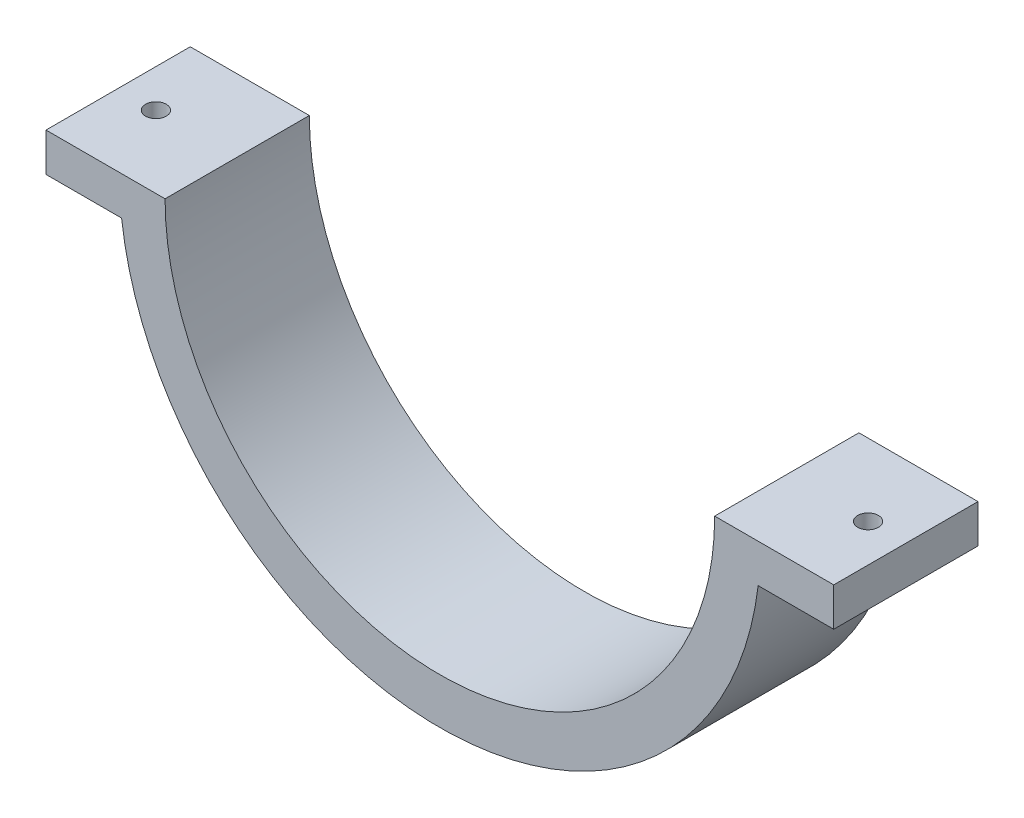
ISO-10303-21;
HEADER;
FILE_DESCRIPTION(('STEP AP214'),'2;1');
FILE_NAME('part.step','',(''),(''),'','','');
FILE_SCHEMA(('AUTOMOTIVE_DESIGN { 1 0 10303 214 1 1 1 1 }'));
ENDSEC;
DATA;
#1=APPLICATION_CONTEXT('core data for automotive mechanical design processes');
#2=APPLICATION_PROTOCOL_DEFINITION('international standard','automotive_design',2000,#1);
#3=PRODUCT_CONTEXT('',#1,'mechanical');
#4=PRODUCT('Part','Part','',(#3));
#5=PRODUCT_RELATED_PRODUCT_CATEGORY('part','',(#4));
#6=PRODUCT_DEFINITION_FORMATION('','',#4);
#7=PRODUCT_DEFINITION_CONTEXT('part definition',#1,'design');
#8=PRODUCT_DEFINITION('design','',#6,#7);
#9=PRODUCT_DEFINITION_SHAPE('','',#8);
#10=(LENGTH_UNIT() NAMED_UNIT(*) SI_UNIT(.MILLI.,.METRE.));
#11=(NAMED_UNIT(*) PLANE_ANGLE_UNIT() SI_UNIT($,.RADIAN.));
#12=(NAMED_UNIT(*) SI_UNIT($,.STERADIAN.) SOLID_ANGLE_UNIT());
#13=UNCERTAINTY_MEASURE_WITH_UNIT(LENGTH_MEASURE(1.E-05),#10,'distance_accuracy_value','');
#14=(GEOMETRIC_REPRESENTATION_CONTEXT(3) GLOBAL_UNCERTAINTY_ASSIGNED_CONTEXT((#13)) GLOBAL_UNIT_ASSIGNED_CONTEXT((#10,
#11,#12)) REPRESENTATION_CONTEXT('',''));
#15=CARTESIAN_POINT('',(0.,0.,0.));
#16=DIRECTION('',(0.,0.,1.));
#17=DIRECTION('',(1.,0.,0.));
#18=AXIS2_PLACEMENT_3D('',#15,#16,#17);
#19=CARTESIAN_POINT('',(0.,0.,30.));
#20=DIRECTION('',(0.,1.,0.));
#21=DIRECTION('',(0.,0.,1.));
#22=AXIS2_PLACEMENT_3D('',#19,#20,#21);
#23=PLANE('',#22);
#24=CARTESIAN_POINT('',(-74.0529100467479,0.,15.));
#25=DIRECTION('',(0.,1.,0.));
#26=DIRECTION('',(0.,0.,1.));
#27=AXIS2_PLACEMENT_3D('',#24,#25,#26);
#28=CIRCLE('',#27,2.15265000000001);
#29=CARTESIAN_POINT('',(-74.0529100467479,0.,17.15265));
#30=VERTEX_POINT('',#29);
#31=EDGE_CURVE('E103',#30,#30,#28,.T.);
#32=ORIENTED_EDGE('',*,*,#31,.F.);
#33=EDGE_LOOP('',(#32));
#34=FACE_BOUND('',#33,.T.);
#35=DIRECTION('',(0.,0.,-1.));
#36=VECTOR('',#35,1.);
#37=CARTESIAN_POINT('',(-57.15,0.,30.));
#38=LINE('',#37,#36);
#39=CARTESIAN_POINT('',(-57.15,0.,30.));
#40=VERTEX_POINT('',#39);
#41=CARTESIAN_POINT('',(-57.15,0.,0.));
#42=VERTEX_POINT('',#41);
#43=EDGE_CURVE('E43',#40,#42,#38,.T.);
#44=ORIENTED_EDGE('',*,*,#43,.T.);
#45=DIRECTION('',(1.,0.,0.));
#46=VECTOR('',#45,1.);
#47=CARTESIAN_POINT('',(0.,0.,0.));
#48=LINE('',#47,#46);
#49=CARTESIAN_POINT('',(-81.9125,0.,0.));
#50=VERTEX_POINT('',#49);
#51=EDGE_CURVE('E74',#50,#42,#48,.T.);
#52=ORIENTED_EDGE('',*,*,#51,.F.);
#53=DIRECTION('',(0.,0.,1.));
#54=VECTOR('',#53,1.);
#55=CARTESIAN_POINT('',(-81.9125,0.,0.));
#56=LINE('',#55,#54);
#57=CARTESIAN_POINT('',(-81.9125,0.,30.));
#58=VERTEX_POINT('',#57);
#59=EDGE_CURVE('E118',#50,#58,#56,.T.);
#60=ORIENTED_EDGE('',*,*,#59,.T.);
#61=DIRECTION('',(1.,0.,0.));
#62=VECTOR('',#61,1.);
#63=CARTESIAN_POINT('',(0.,0.,30.));
#64=LINE('',#63,#62);
#65=EDGE_CURVE('E60',#58,#40,#64,.T.);
#66=ORIENTED_EDGE('',*,*,#65,.T.);
#67=EDGE_LOOP('',(#44,#52,#60,#66));
#68=FACE_BOUND('',#67,.T.);
#69=ADVANCED_FACE('F35',(#34,#68),#23,.T.);
#70=CARTESIAN_POINT('',(0.,0.,30.));
#71=DIRECTION('',(0.,0.,-1.));
#72=DIRECTION('',(-1.,0.,0.));
#73=AXIS2_PLACEMENT_3D('',#70,#71,#72);
#74=CYLINDRICAL_SURFACE('',#73,66.675);
#75=CARTESIAN_POINT('',(0.,0.,30.));
#76=DIRECTION('',(0.,0.,1.));
#77=DIRECTION('',(1.,0.,0.));
#78=AXIS2_PLACEMENT_3D('',#75,#76,#77);
#79=CIRCLE('',#78,66.675);
#80=CARTESIAN_POINT('',(-66.1933200934958,-8.,30.));
#81=VERTEX_POINT('',#80);
#82=CARTESIAN_POINT('',(66.1933200934958,-8.,30.));
#83=VERTEX_POINT('',#82);
#84=EDGE_CURVE('E96',#81,#83,#79,.T.);
#85=ORIENTED_EDGE('',*,*,#84,.F.);
#86=DIRECTION('',(0.,0.,-1.));
#87=VECTOR('',#86,1.);
#88=CARTESIAN_POINT('',(-66.1933200934958,-8.,30.));
#89=LINE('',#88,#87);
#90=CARTESIAN_POINT('',(-66.1933200934958,-8.,0.));
#91=VERTEX_POINT('',#90);
#92=EDGE_CURVE('E124',#81,#91,#89,.T.);
#93=ORIENTED_EDGE('',*,*,#92,.T.);
#94=CARTESIAN_POINT('',(0.,0.,0.));
#95=DIRECTION('',(0.,0.,1.));
#96=DIRECTION('',(1.,0.,0.));
#97=AXIS2_PLACEMENT_3D('',#94,#95,#96);
#98=CIRCLE('',#97,66.675);
#99=CARTESIAN_POINT('',(66.1933200934958,-8.,0.));
#100=VERTEX_POINT('',#99);
#101=EDGE_CURVE('E84',#91,#100,#98,.T.);
#102=ORIENTED_EDGE('',*,*,#101,.T.);
#103=DIRECTION('',(0.,0.,-1.));
#104=VECTOR('',#103,1.);
#105=CARTESIAN_POINT('',(66.1933200934958,-8.,30.));
#106=LINE('',#105,#104);
#107=EDGE_CURVE('E85',#100,#83,#106,.F.);
#108=ORIENTED_EDGE('',*,*,#107,.T.);
#109=EDGE_LOOP('',(#85,#93,#102,#108));
#110=FACE_BOUND('',#109,.T.);
#111=ADVANCED_FACE('F157',(#110),#74,.T.);
#112=CARTESIAN_POINT('',(0.,0.,30.));
#113=DIRECTION('',(0.,1.,0.));
#114=DIRECTION('',(0.,0.,1.));
#115=AXIS2_PLACEMENT_3D('',#112,#113,#114);
#116=PLANE('',#115);
#117=CARTESIAN_POINT('',(74.0529100467479,0.,15.));
#118=DIRECTION('',(0.,1.,0.));
#119=DIRECTION('',(0.,0.,-1.));
#120=AXIS2_PLACEMENT_3D('',#117,#118,#119);
#121=CIRCLE('',#120,2.15265000000001);
#122=CARTESIAN_POINT('',(74.0529100467479,0.,12.84735));
#123=VERTEX_POINT('',#122);
#124=EDGE_CURVE('E112',#123,#123,#121,.T.);
#125=ORIENTED_EDGE('',*,*,#124,.F.);
#126=EDGE_LOOP('',(#125));
#127=FACE_BOUND('',#126,.T.);
#128=DIRECTION('',(1.,0.,0.));
#129=VECTOR('',#128,1.);
#130=CARTESIAN_POINT('',(0.,0.,30.));
#131=LINE('',#130,#129);
#132=CARTESIAN_POINT('',(57.15,0.,30.));
#133=VERTEX_POINT('',#132);
#134=CARTESIAN_POINT('',(81.9125,0.,30.));
#135=VERTEX_POINT('',#134);
#136=EDGE_CURVE('E149',#133,#135,#131,.T.);
#137=ORIENTED_EDGE('',*,*,#136,.T.);
#138=DIRECTION('',(0.,0.,1.));
#139=VECTOR('',#138,1.);
#140=CARTESIAN_POINT('',(81.9125,0.,0.));
#141=LINE('',#140,#139);
#142=CARTESIAN_POINT('',(81.9125,0.,0.));
#143=VERTEX_POINT('',#142);
#144=EDGE_CURVE('E141',#143,#135,#141,.T.);
#145=ORIENTED_EDGE('',*,*,#144,.F.);
#146=DIRECTION('',(1.,0.,0.));
#147=VECTOR('',#146,1.);
#148=CARTESIAN_POINT('',(0.,0.,0.));
#149=LINE('',#148,#147);
#150=CARTESIAN_POINT('',(57.15,0.,0.));
#151=VERTEX_POINT('',#150);
#152=EDGE_CURVE('E94',#151,#143,#149,.T.);
#153=ORIENTED_EDGE('',*,*,#152,.F.);
#154=DIRECTION('',(0.,0.,-1.));
#155=VECTOR('',#154,1.);
#156=CARTESIAN_POINT('',(57.15,0.,30.));
#157=LINE('',#156,#155);
#158=EDGE_CURVE('E11',#133,#151,#157,.T.);
#159=ORIENTED_EDGE('',*,*,#158,.F.);
#160=EDGE_LOOP('',(#137,#145,#153,#159));
#161=FACE_BOUND('',#160,.T.);
#162=ADVANCED_FACE('F182',(#127,#161),#116,.T.);
#163=CARTESIAN_POINT('',(0.,0.,30.));
#164=DIRECTION('',(0.,0.,-1.));
#165=DIRECTION('',(-1.,0.,0.));
#166=AXIS2_PLACEMENT_3D('',#163,#164,#165);
#167=CYLINDRICAL_SURFACE('',#166,57.15);
#168=CARTESIAN_POINT('',(0.,0.,0.));
#169=DIRECTION('',(0.,0.,1.));
#170=DIRECTION('',(1.,0.,0.));
#171=AXIS2_PLACEMENT_3D('',#168,#169,#170);
#172=CIRCLE('',#171,57.15);
#173=EDGE_CURVE('E78',#42,#151,#172,.T.);
#174=ORIENTED_EDGE('',*,*,#173,.F.);
#175=ORIENTED_EDGE('',*,*,#43,.F.);
#176=CARTESIAN_POINT('',(0.,0.,30.));
#177=DIRECTION('',(0.,0.,1.));
#178=DIRECTION('',(1.,0.,0.));
#179=AXIS2_PLACEMENT_3D('',#176,#177,#178);
#180=CIRCLE('',#179,57.15);
#181=EDGE_CURVE('E90',#40,#133,#180,.T.);
#182=ORIENTED_EDGE('',*,*,#181,.T.);
#183=ORIENTED_EDGE('',*,*,#158,.T.);
#184=EDGE_LOOP('',(#174,#175,#182,#183));
#185=FACE_BOUND('',#184,.T.);
#186=ADVANCED_FACE('F92',(#185),#167,.F.);
#187=CARTESIAN_POINT('',(0.,0.,30.));
#188=DIRECTION('',(0.,0.,1.));
#189=DIRECTION('',(1.,0.,0.));
#190=AXIS2_PLACEMENT_3D('',#187,#188,#189);
#191=PLANE('',#190);
#192=ORIENTED_EDGE('',*,*,#181,.F.);
#193=ORIENTED_EDGE('',*,*,#65,.F.);
#194=DIRECTION('',(0.,-1.,0.));
#195=VECTOR('',#194,1.);
#196=CARTESIAN_POINT('',(-81.9125,0.,30.));
#197=LINE('',#196,#195);
#198=CARTESIAN_POINT('',(-81.9125,-8.,30.));
#199=VERTEX_POINT('',#198);
#200=EDGE_CURVE('E102',#58,#199,#197,.T.);
#201=ORIENTED_EDGE('',*,*,#200,.T.);
#202=DIRECTION('',(1.,0.,0.));
#203=VECTOR('',#202,1.);
#204=CARTESIAN_POINT('',(-61.9125,-8.,30.));
#205=LINE('',#204,#203);
#206=EDGE_CURVE('E51',#199,#81,#205,.T.);
#207=ORIENTED_EDGE('',*,*,#206,.T.);
#208=ORIENTED_EDGE('',*,*,#84,.T.);
#209=DIRECTION('',(1.,0.,0.));
#210=VECTOR('',#209,1.);
#211=CARTESIAN_POINT('',(61.9125,-8.,30.));
#212=LINE('',#211,#210);
#213=CARTESIAN_POINT('',(81.9125,-8.,30.));
#214=VERTEX_POINT('',#213);
#215=EDGE_CURVE('E128',#83,#214,#212,.T.);
#216=ORIENTED_EDGE('',*,*,#215,.T.);
#217=DIRECTION('',(0.,1.,0.));
#218=VECTOR('',#217,1.);
#219=CARTESIAN_POINT('',(81.9125,0.,30.));
#220=LINE('',#219,#218);
#221=EDGE_CURVE('E133',#214,#135,#220,.T.);
#222=ORIENTED_EDGE('',*,*,#221,.T.);
#223=ORIENTED_EDGE('',*,*,#136,.F.);
#224=EDGE_LOOP('',(#192,#193,#201,#207,#208,#216,#222,#223));
#225=FACE_BOUND('',#224,.T.);
#226=ADVANCED_FACE('F183',(#225),#191,.T.);
#227=CARTESIAN_POINT('',(0.,0.,0.));
#228=DIRECTION('',(0.,0.,1.));
#229=DIRECTION('',(1.,0.,0.));
#230=AXIS2_PLACEMENT_3D('',#227,#228,#229);
#231=PLANE('',#230);
#232=ORIENTED_EDGE('',*,*,#51,.T.);
#233=ORIENTED_EDGE('',*,*,#173,.T.);
#234=ORIENTED_EDGE('',*,*,#152,.T.);
#235=DIRECTION('',(0.,1.,0.));
#236=VECTOR('',#235,1.);
#237=CARTESIAN_POINT('',(81.9125,0.,0.));
#238=LINE('',#237,#236);
#239=CARTESIAN_POINT('',(81.9125,-8.,0.));
#240=VERTEX_POINT('',#239);
#241=EDGE_CURVE('E132',#240,#143,#238,.T.);
#242=ORIENTED_EDGE('',*,*,#241,.F.);
#243=DIRECTION('',(1.,0.,0.));
#244=VECTOR('',#243,1.);
#245=CARTESIAN_POINT('',(61.9125,-8.,0.));
#246=LINE('',#245,#244);
#247=EDGE_CURVE('E129',#100,#240,#246,.T.);
#248=ORIENTED_EDGE('',*,*,#247,.F.);
#249=ORIENTED_EDGE('',*,*,#101,.F.);
#250=DIRECTION('',(1.,0.,0.));
#251=VECTOR('',#250,1.);
#252=CARTESIAN_POINT('',(-61.9125,-8.,0.));
#253=LINE('',#252,#251);
#254=CARTESIAN_POINT('',(-81.9125,-8.,0.));
#255=VERTEX_POINT('',#254);
#256=EDGE_CURVE('E116',#255,#91,#253,.T.);
#257=ORIENTED_EDGE('',*,*,#256,.F.);
#258=DIRECTION('',(0.,-1.,0.));
#259=VECTOR('',#258,1.);
#260=CARTESIAN_POINT('',(-81.9125,0.,0.));
#261=LINE('',#260,#259);
#262=EDGE_CURVE('E82',#50,#255,#261,.T.);
#263=ORIENTED_EDGE('',*,*,#262,.F.);
#264=EDGE_LOOP('',(#232,#233,#234,#242,#248,#249,#257,#263));
#265=FACE_BOUND('',#264,.T.);
#266=ADVANCED_FACE('F75',(#265),#231,.F.);
#267=CARTESIAN_POINT('',(61.9125,-8.,0.));
#268=DIRECTION('',(0.,-1.,0.));
#269=DIRECTION('',(0.,0.,-1.));
#270=AXIS2_PLACEMENT_3D('',#267,#268,#269);
#271=PLANE('',#270);
#272=CARTESIAN_POINT('',(74.0529100467479,-8.,15.));
#273=DIRECTION('',(0.,-1.,0.));
#274=DIRECTION('',(0.,0.,-1.));
#275=AXIS2_PLACEMENT_3D('',#272,#273,#274);
#276=CIRCLE('',#275,2.15265000000001);
#277=CARTESIAN_POINT('',(74.0529100467479,-8.,12.84735));
#278=VERTEX_POINT('',#277);
#279=EDGE_CURVE('E38',#278,#278,#276,.T.);
#280=ORIENTED_EDGE('',*,*,#279,.F.);
#281=EDGE_LOOP('',(#280));
#282=FACE_BOUND('',#281,.T.);
#283=ORIENTED_EDGE('',*,*,#107,.F.);
#284=ORIENTED_EDGE('',*,*,#247,.T.);
#285=DIRECTION('',(0.,0.,1.));
#286=VECTOR('',#285,1.);
#287=CARTESIAN_POINT('',(81.9125,-8.,0.));
#288=LINE('',#287,#286);
#289=EDGE_CURVE('E136',#240,#214,#288,.T.);
#290=ORIENTED_EDGE('',*,*,#289,.T.);
#291=ORIENTED_EDGE('',*,*,#215,.F.);
#292=EDGE_LOOP('',(#283,#284,#290,#291));
#293=FACE_BOUND('',#292,.T.);
#294=ADVANCED_FACE('F163',(#282,#293),#271,.T.);
#295=CARTESIAN_POINT('',(81.9125,0.,0.));
#296=DIRECTION('',(1.,0.,0.));
#297=DIRECTION('',(0.,0.,-1.));
#298=AXIS2_PLACEMENT_3D('',#295,#296,#297);
#299=PLANE('',#298);
#300=ORIENTED_EDGE('',*,*,#221,.F.);
#301=ORIENTED_EDGE('',*,*,#289,.F.);
#302=ORIENTED_EDGE('',*,*,#241,.T.);
#303=ORIENTED_EDGE('',*,*,#144,.T.);
#304=EDGE_LOOP('',(#300,#301,#302,#303));
#305=FACE_BOUND('',#304,.T.);
#306=ADVANCED_FACE('F173',(#305),#299,.T.);
#307=CARTESIAN_POINT('',(-61.9125,-8.,0.));
#308=DIRECTION('',(0.,-1.,0.));
#309=DIRECTION('',(1.,0.,0.));
#310=AXIS2_PLACEMENT_3D('',#307,#308,#309);
#311=PLANE('',#310);
#312=CARTESIAN_POINT('',(-74.0529100467479,-8.,15.));
#313=DIRECTION('',(0.,-1.,0.));
#314=DIRECTION('',(1.,0.,0.));
#315=AXIS2_PLACEMENT_3D('',#312,#313,#314);
#316=CIRCLE('',#315,2.15265000000001);
#317=CARTESIAN_POINT('',(-71.9002600467479,-8.,15.));
#318=VERTEX_POINT('',#317);
#319=EDGE_CURVE('E100',#318,#318,#316,.T.);
#320=ORIENTED_EDGE('',*,*,#319,.F.);
#321=EDGE_LOOP('',(#320));
#322=FACE_BOUND('',#321,.T.);
#323=ORIENTED_EDGE('',*,*,#92,.F.);
#324=ORIENTED_EDGE('',*,*,#206,.F.);
#325=DIRECTION('',(0.,0.,1.));
#326=VECTOR('',#325,1.);
#327=CARTESIAN_POINT('',(-81.9125,-8.,0.));
#328=LINE('',#327,#326);
#329=EDGE_CURVE('E121',#255,#199,#328,.T.);
#330=ORIENTED_EDGE('',*,*,#329,.F.);
#331=ORIENTED_EDGE('',*,*,#256,.T.);
#332=EDGE_LOOP('',(#323,#324,#330,#331));
#333=FACE_BOUND('',#332,.T.);
#334=ADVANCED_FACE('F194',(#322,#333),#311,.T.);
#335=CARTESIAN_POINT('',(-81.9125,0.,0.));
#336=DIRECTION('',(-1.,0.,0.));
#337=DIRECTION('',(0.,0.,1.));
#338=AXIS2_PLACEMENT_3D('',#335,#336,#337);
#339=PLANE('',#338);
#340=ORIENTED_EDGE('',*,*,#200,.F.);
#341=ORIENTED_EDGE('',*,*,#59,.F.);
#342=ORIENTED_EDGE('',*,*,#262,.T.);
#343=ORIENTED_EDGE('',*,*,#329,.T.);
#344=EDGE_LOOP('',(#340,#341,#342,#343));
#345=FACE_BOUND('',#344,.T.);
#346=ADVANCED_FACE('F189',(#345),#339,.T.);
#347=CARTESIAN_POINT('',(-74.0529100467479,-66.675,15.));
#348=DIRECTION('',(0.,1.,0.));
#349=DIRECTION('',(0.,0.,1.));
#350=AXIS2_PLACEMENT_3D('',#347,#348,#349);
#351=CYLINDRICAL_SURFACE('',#350,2.15265000000001);
#352=ORIENTED_EDGE('',*,*,#319,.T.);
#353=EDGE_LOOP('',(#352));
#354=FACE_BOUND('',#353,.T.);
#355=ORIENTED_EDGE('',*,*,#31,.T.);
#356=EDGE_LOOP('',(#355));
#357=FACE_BOUND('',#356,.T.);
#358=ADVANCED_FACE('F204',(#354,#357),#351,.F.);
#359=CARTESIAN_POINT('',(74.0529100467479,-66.675,15.));
#360=DIRECTION('',(0.,1.,0.));
#361=DIRECTION('',(0.,0.,1.));
#362=AXIS2_PLACEMENT_3D('',#359,#360,#361);
#363=CYLINDRICAL_SURFACE('',#362,2.15265000000001);
#364=ORIENTED_EDGE('',*,*,#279,.T.);
#365=EDGE_LOOP('',(#364));
#366=FACE_BOUND('',#365,.T.);
#367=ORIENTED_EDGE('',*,*,#124,.T.);
#368=EDGE_LOOP('',(#367));
#369=FACE_BOUND('',#368,.T.);
#370=ADVANCED_FACE('F231',(#366,#369),#363,.F.);
#371=CLOSED_SHELL('',(#69,#111,#162,#186,#226,#266,#294,#306,#334,#346,#358,#370));
#372=MANIFOLD_SOLID_BREP('B2',#371);
#373=ADVANCED_BREP_SHAPE_REPRESENTATION('',(#18,#372),#14);
#374=SHAPE_DEFINITION_REPRESENTATION(#9,#373);
ENDSEC;
END-ISO-10303-21;
